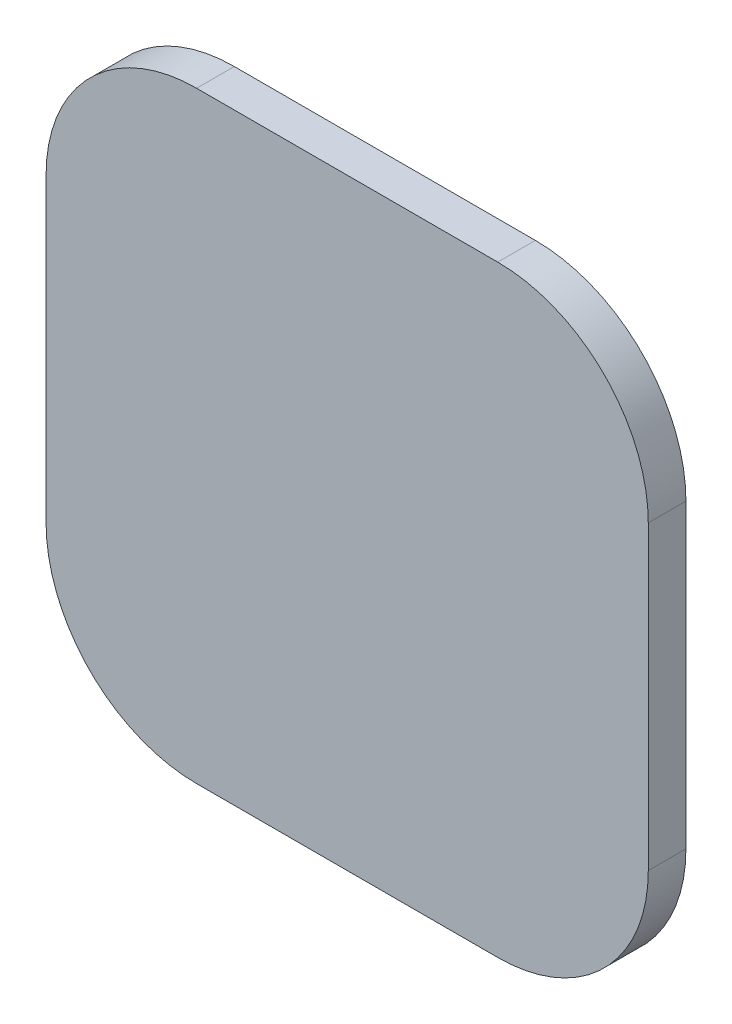
ISO-10303-21;
HEADER;
FILE_DESCRIPTION(('STEP AP214'),'2;1');
FILE_NAME('part.step','',(''),(''),'','','');
FILE_SCHEMA(('AUTOMOTIVE_DESIGN { 1 0 10303 214 1 1 1 1 }'));
ENDSEC;
DATA;
#1=APPLICATION_CONTEXT('core data for automotive mechanical design processes');
#2=APPLICATION_PROTOCOL_DEFINITION('international standard','automotive_design',2000,#1);
#3=PRODUCT_CONTEXT('',#1,'mechanical');
#4=PRODUCT('Part','Part','',(#3));
#5=PRODUCT_RELATED_PRODUCT_CATEGORY('part','',(#4));
#6=PRODUCT_DEFINITION_FORMATION('','',#4);
#7=PRODUCT_DEFINITION_CONTEXT('part definition',#1,'design');
#8=PRODUCT_DEFINITION('design','',#6,#7);
#9=PRODUCT_DEFINITION_SHAPE('','',#8);
#10=(LENGTH_UNIT() NAMED_UNIT(*) SI_UNIT(.MILLI.,.METRE.));
#11=(NAMED_UNIT(*) PLANE_ANGLE_UNIT() SI_UNIT($,.RADIAN.));
#12=(NAMED_UNIT(*) SI_UNIT($,.STERADIAN.) SOLID_ANGLE_UNIT());
#13=UNCERTAINTY_MEASURE_WITH_UNIT(LENGTH_MEASURE(1.E-05),#10,'distance_accuracy_value','');
#14=(GEOMETRIC_REPRESENTATION_CONTEXT(3) GLOBAL_UNCERTAINTY_ASSIGNED_CONTEXT((#13)) GLOBAL_UNIT_ASSIGNED_CONTEXT((#10,
#11,#12)) REPRESENTATION_CONTEXT('',''));
#15=CARTESIAN_POINT('',(0.,0.,0.));
#16=DIRECTION('',(0.,0.,1.));
#17=DIRECTION('',(1.,0.,0.));
#18=AXIS2_PLACEMENT_3D('',#15,#16,#17);
#19=CARTESIAN_POINT('',(0.,0.,2.));
#20=DIRECTION('',(0.,0.,-1.));
#21=DIRECTION('',(-1.,0.,0.));
#22=AXIS2_PLACEMENT_3D('',#19,#20,#21);
#23=PLANE('',#22);
#24=CARTESIAN_POINT('',(0.,0.,2.));
#25=DIRECTION('',(0.,0.,-1.));
#26=DIRECTION('',(-1.,0.,0.));
#27=AXIS2_PLACEMENT_3D('',#24,#25,#26);
#28=CIRCLE('',#27,12.0393920141695);
#29=CARTESIAN_POINT('',(-12.0393920141695,0.,2.));
#30=VERTEX_POINT('',#29);
#31=EDGE_CURVE('E11',#30,#30,#28,.F.);
#32=ORIENTED_EDGE('',*,*,#31,.T.);
#33=EDGE_LOOP('',(#32));
#34=FACE_BOUND('',#33,.T.);
#35=CARTESIAN_POINT('',(0.,0.,2.));
#36=DIRECTION('',(0.,0.,-1.));
#37=DIRECTION('',(-1.,0.,0.));
#38=AXIS2_PLACEMENT_3D('',#35,#36,#37);
#39=CIRCLE('',#38,20.);
#40=CARTESIAN_POINT('',(-20.,0.,2.));
#41=VERTEX_POINT('',#40);
#42=EDGE_CURVE('E161',#41,#41,#39,.T.);
#43=ORIENTED_EDGE('',*,*,#42,.T.);
#44=EDGE_LOOP('',(#43));
#45=FACE_BOUND('',#44,.T.);
#46=ADVANCED_FACE('F43',(#34,#45),#23,.T.);
#47=CARTESIAN_POINT('',(20.,20.,5.));
#48=DIRECTION('',(0.,0.,-1.));
#49=DIRECTION('',(-1.,0.,0.));
#50=AXIS2_PLACEMENT_3D('',#47,#48,#49);
#51=CYLINDRICAL_SURFACE('',#50,20.);
#52=CARTESIAN_POINT('',(20.,20.,0.));
#53=DIRECTION('',(0.,0.,1.));
#54=DIRECTION('',(1.,0.,0.));
#55=AXIS2_PLACEMENT_3D('',#52,#53,#54);
#56=CIRCLE('',#55,20.);
#57=CARTESIAN_POINT('',(40.,19.9999999999999,0.));
#58=VERTEX_POINT('',#57);
#59=CARTESIAN_POINT('',(19.9999999999999,40.,0.));
#60=VERTEX_POINT('',#59);
#61=EDGE_CURVE('E156',#58,#60,#56,.T.);
#62=ORIENTED_EDGE('',*,*,#61,.T.);
#63=DIRECTION('',(0.,0.,-1.));
#64=VECTOR('',#63,1.);
#65=CARTESIAN_POINT('',(19.9999999999999,40.,5.));
#66=LINE('',#65,#64);
#67=CARTESIAN_POINT('',(19.9999999999999,40.,5.));
#68=VERTEX_POINT('',#67);
#69=EDGE_CURVE('E52',#68,#60,#66,.T.);
#70=ORIENTED_EDGE('',*,*,#69,.F.);
#71=CARTESIAN_POINT('',(20.,20.,5.));
#72=DIRECTION('',(0.,0.,1.));
#73=DIRECTION('',(1.,0.,0.));
#74=AXIS2_PLACEMENT_3D('',#71,#72,#73);
#75=CIRCLE('',#74,20.);
#76=CARTESIAN_POINT('',(40.,19.9999999999999,5.));
#77=VERTEX_POINT('',#76);
#78=EDGE_CURVE('E180',#77,#68,#75,.T.);
#79=ORIENTED_EDGE('',*,*,#78,.F.);
#80=DIRECTION('',(0.,0.,-1.));
#81=VECTOR('',#80,1.);
#82=CARTESIAN_POINT('',(40.,19.9999999999999,5.));
#83=LINE('',#82,#81);
#84=EDGE_CURVE('E152',#77,#58,#83,.T.);
#85=ORIENTED_EDGE('',*,*,#84,.T.);
#86=EDGE_LOOP('',(#62,#70,#79,#85));
#87=FACE_BOUND('',#86,.T.);
#88=ADVANCED_FACE('F204',(#87),#51,.T.);
#89=CARTESIAN_POINT('',(-19.9999999999999,40.,5.));
#90=DIRECTION('',(0.,-1.,0.));
#91=DIRECTION('',(0.,0.,-1.));
#92=AXIS2_PLACEMENT_3D('',#89,#90,#91);
#93=PLANE('',#92);
#94=DIRECTION('',(-1.,0.,0.));
#95=VECTOR('',#94,1.);
#96=CARTESIAN_POINT('',(-19.9999999999999,40.,0.));
#97=LINE('',#96,#95);
#98=CARTESIAN_POINT('',(-19.9999999999999,40.,0.));
#99=VERTEX_POINT('',#98);
#100=EDGE_CURVE('E160',#60,#99,#97,.T.);
#101=ORIENTED_EDGE('',*,*,#100,.T.);
#102=DIRECTION('',(0.,0.,-1.));
#103=VECTOR('',#102,1.);
#104=CARTESIAN_POINT('',(-19.9999999999999,40.,5.));
#105=LINE('',#104,#103);
#106=CARTESIAN_POINT('',(-19.9999999999999,40.,5.));
#107=VERTEX_POINT('',#106);
#108=EDGE_CURVE('E195',#107,#99,#105,.T.);
#109=ORIENTED_EDGE('',*,*,#108,.F.);
#110=DIRECTION('',(-1.,0.,0.));
#111=VECTOR('',#110,1.);
#112=CARTESIAN_POINT('',(-19.9999999999999,40.,5.));
#113=LINE('',#112,#111);
#114=EDGE_CURVE('E109',#68,#107,#113,.T.);
#115=ORIENTED_EDGE('',*,*,#114,.F.);
#116=ORIENTED_EDGE('',*,*,#69,.T.);
#117=EDGE_LOOP('',(#101,#109,#115,#116));
#118=FACE_BOUND('',#117,.T.);
#119=ADVANCED_FACE('F200',(#118),#93,.F.);
#120=CARTESIAN_POINT('',(-20.,20.,5.));
#121=DIRECTION('',(0.,0.,-1.));
#122=DIRECTION('',(-1.,0.,0.));
#123=AXIS2_PLACEMENT_3D('',#120,#121,#122);
#124=CYLINDRICAL_SURFACE('',#123,20.);
#125=CARTESIAN_POINT('',(-20.,20.,0.));
#126=DIRECTION('',(0.,0.,1.));
#127=DIRECTION('',(-1.,0.,0.));
#128=AXIS2_PLACEMENT_3D('',#125,#126,#127);
#129=CIRCLE('',#128,20.);
#130=CARTESIAN_POINT('',(-40.,19.9999999999999,0.));
#131=VERTEX_POINT('',#130);
#132=EDGE_CURVE('E164',#99,#131,#129,.T.);
#133=ORIENTED_EDGE('',*,*,#132,.T.);
#134=DIRECTION('',(0.,0.,-1.));
#135=VECTOR('',#134,1.);
#136=CARTESIAN_POINT('',(-40.,19.9999999999999,5.));
#137=LINE('',#136,#135);
#138=CARTESIAN_POINT('',(-40.,19.9999999999999,5.));
#139=VERTEX_POINT('',#138);
#140=EDGE_CURVE('E191',#139,#131,#137,.T.);
#141=ORIENTED_EDGE('',*,*,#140,.F.);
#142=CARTESIAN_POINT('',(-20.,20.,5.));
#143=DIRECTION('',(0.,0.,1.));
#144=DIRECTION('',(-1.,0.,0.));
#145=AXIS2_PLACEMENT_3D('',#142,#143,#144);
#146=CIRCLE('',#145,20.);
#147=EDGE_CURVE('E220',#107,#139,#146,.T.);
#148=ORIENTED_EDGE('',*,*,#147,.F.);
#149=ORIENTED_EDGE('',*,*,#108,.T.);
#150=EDGE_LOOP('',(#133,#141,#148,#149));
#151=FACE_BOUND('',#150,.T.);
#152=ADVANCED_FACE('F212',(#151),#124,.T.);
#153=CARTESIAN_POINT('',(-40.,-19.9999999999999,5.));
#154=DIRECTION('',(1.,0.,0.));
#155=DIRECTION('',(0.,0.,-1.));
#156=AXIS2_PLACEMENT_3D('',#153,#154,#155);
#157=PLANE('',#156);
#158=DIRECTION('',(0.,-1.,0.));
#159=VECTOR('',#158,1.);
#160=CARTESIAN_POINT('',(-40.,-19.9999999999999,0.));
#161=LINE('',#160,#159);
#162=CARTESIAN_POINT('',(-40.,-20.,0.));
#163=VERTEX_POINT('',#162);
#164=EDGE_CURVE('E167',#131,#163,#161,.T.);
#165=ORIENTED_EDGE('',*,*,#164,.T.);
#166=DIRECTION('',(0.,0.,-1.));
#167=VECTOR('',#166,1.);
#168=CARTESIAN_POINT('',(-40.,-20.,5.));
#169=LINE('',#168,#167);
#170=CARTESIAN_POINT('',(-40.,-20.,5.));
#171=VERTEX_POINT('',#170);
#172=EDGE_CURVE('E187',#171,#163,#169,.T.);
#173=ORIENTED_EDGE('',*,*,#172,.F.);
#174=DIRECTION('',(0.,-1.,0.));
#175=VECTOR('',#174,1.);
#176=CARTESIAN_POINT('',(-40.,-19.9999999999999,5.));
#177=LINE('',#176,#175);
#178=EDGE_CURVE('E218',#139,#171,#177,.T.);
#179=ORIENTED_EDGE('',*,*,#178,.F.);
#180=ORIENTED_EDGE('',*,*,#140,.T.);
#181=EDGE_LOOP('',(#165,#173,#179,#180));
#182=FACE_BOUND('',#181,.T.);
#183=ADVANCED_FACE('F216',(#182),#157,.F.);
#184=CARTESIAN_POINT('',(-20.,-20.,5.));
#185=DIRECTION('',(0.,0.,-1.));
#186=DIRECTION('',(-1.,0.,0.));
#187=AXIS2_PLACEMENT_3D('',#184,#185,#186);
#188=CYLINDRICAL_SURFACE('',#187,20.);
#189=CARTESIAN_POINT('',(-20.,-20.,0.));
#190=DIRECTION('',(0.,0.,1.));
#191=DIRECTION('',(-1.,0.,0.));
#192=AXIS2_PLACEMENT_3D('',#189,#190,#191);
#193=CIRCLE('',#192,20.);
#194=CARTESIAN_POINT('',(-19.9999999999999,-40.,0.));
#195=VERTEX_POINT('',#194);
#196=EDGE_CURVE('E170',#163,#195,#193,.T.);
#197=ORIENTED_EDGE('',*,*,#196,.T.);
#198=DIRECTION('',(0.,0.,-1.));
#199=VECTOR('',#198,1.);
#200=CARTESIAN_POINT('',(-19.9999999999999,-40.,5.));
#201=LINE('',#200,#199);
#202=CARTESIAN_POINT('',(-19.9999999999999,-40.,5.));
#203=VERTEX_POINT('',#202);
#204=EDGE_CURVE('E145',#203,#195,#201,.T.);
#205=ORIENTED_EDGE('',*,*,#204,.F.);
#206=CARTESIAN_POINT('',(-20.,-20.,5.));
#207=DIRECTION('',(0.,0.,1.));
#208=DIRECTION('',(-1.,0.,0.));
#209=AXIS2_PLACEMENT_3D('',#206,#207,#208);
#210=CIRCLE('',#209,20.);
#211=EDGE_CURVE('E131',#171,#203,#210,.T.);
#212=ORIENTED_EDGE('',*,*,#211,.F.);
#213=ORIENTED_EDGE('',*,*,#172,.T.);
#214=EDGE_LOOP('',(#197,#205,#212,#213));
#215=FACE_BOUND('',#214,.T.);
#216=ADVANCED_FACE('F313',(#215),#188,.T.);
#217=CARTESIAN_POINT('',(-19.9999999999999,-40.,5.));
#218=DIRECTION('',(0.,1.,0.));
#219=DIRECTION('',(0.,0.,1.));
#220=AXIS2_PLACEMENT_3D('',#217,#218,#219);
#221=PLANE('',#220);
#222=DIRECTION('',(1.,0.,0.));
#223=VECTOR('',#222,1.);
#224=CARTESIAN_POINT('',(-19.9999999999999,-40.,0.));
#225=LINE('',#224,#223);
#226=CARTESIAN_POINT('',(19.9999999999999,-40.,0.));
#227=VERTEX_POINT('',#226);
#228=EDGE_CURVE('E141',#195,#227,#225,.T.);
#229=ORIENTED_EDGE('',*,*,#228,.T.);
#230=DIRECTION('',(0.,0.,-1.));
#231=VECTOR('',#230,1.);
#232=CARTESIAN_POINT('',(19.9999999999999,-40.,5.));
#233=LINE('',#232,#231);
#234=CARTESIAN_POINT('',(19.9999999999999,-40.,5.));
#235=VERTEX_POINT('',#234);
#236=EDGE_CURVE('E138',#235,#227,#233,.T.);
#237=ORIENTED_EDGE('',*,*,#236,.F.);
#238=DIRECTION('',(1.,0.,0.));
#239=VECTOR('',#238,1.);
#240=CARTESIAN_POINT('',(-19.9999999999999,-40.,5.));
#241=LINE('',#240,#239);
#242=EDGE_CURVE('E124',#203,#235,#241,.T.);
#243=ORIENTED_EDGE('',*,*,#242,.F.);
#244=ORIENTED_EDGE('',*,*,#204,.T.);
#245=EDGE_LOOP('',(#229,#237,#243,#244));
#246=FACE_BOUND('',#245,.T.);
#247=ADVANCED_FACE('F139',(#246),#221,.F.);
#248=CARTESIAN_POINT('',(20.,-20.,5.));
#249=DIRECTION('',(0.,0.,-1.));
#250=DIRECTION('',(-1.,0.,0.));
#251=AXIS2_PLACEMENT_3D('',#248,#249,#250);
#252=CYLINDRICAL_SURFACE('',#251,20.);
#253=CARTESIAN_POINT('',(20.,-20.,0.));
#254=DIRECTION('',(0.,0.,1.));
#255=DIRECTION('',(1.,0.,0.));
#256=AXIS2_PLACEMENT_3D('',#253,#254,#255);
#257=CIRCLE('',#256,20.);
#258=CARTESIAN_POINT('',(40.,-19.9999999999999,0.));
#259=VERTEX_POINT('',#258);
#260=EDGE_CURVE('E175',#227,#259,#257,.T.);
#261=ORIENTED_EDGE('',*,*,#260,.T.);
#262=DIRECTION('',(0.,0.,-1.));
#263=VECTOR('',#262,1.);
#264=CARTESIAN_POINT('',(40.,-19.9999999999999,5.));
#265=LINE('',#264,#263);
#266=CARTESIAN_POINT('',(40.,-19.9999999999999,5.));
#267=VERTEX_POINT('',#266);
#268=EDGE_CURVE('E146',#267,#259,#265,.T.);
#269=ORIENTED_EDGE('',*,*,#268,.F.);
#270=CARTESIAN_POINT('',(20.,-20.,5.));
#271=DIRECTION('',(0.,0.,1.));
#272=DIRECTION('',(1.,0.,0.));
#273=AXIS2_PLACEMENT_3D('',#270,#271,#272);
#274=CIRCLE('',#273,20.);
#275=EDGE_CURVE('E128',#235,#267,#274,.T.);
#276=ORIENTED_EDGE('',*,*,#275,.F.);
#277=ORIENTED_EDGE('',*,*,#236,.T.);
#278=EDGE_LOOP('',(#261,#269,#276,#277));
#279=FACE_BOUND('',#278,.T.);
#280=ADVANCED_FACE('F148',(#279),#252,.T.);
#281=CARTESIAN_POINT('',(40.,-19.9999999999999,5.));
#282=DIRECTION('',(-1.,0.,0.));
#283=DIRECTION('',(0.,0.,1.));
#284=AXIS2_PLACEMENT_3D('',#281,#282,#283);
#285=PLANE('',#284);
#286=DIRECTION('',(0.,1.,0.));
#287=VECTOR('',#286,1.);
#288=CARTESIAN_POINT('',(40.,-19.9999999999999,0.));
#289=LINE('',#288,#287);
#290=EDGE_CURVE('E100',#259,#58,#289,.T.);
#291=ORIENTED_EDGE('',*,*,#290,.T.);
#292=ORIENTED_EDGE('',*,*,#84,.F.);
#293=DIRECTION('',(0.,1.,0.));
#294=VECTOR('',#293,1.);
#295=CARTESIAN_POINT('',(40.,-19.9999999999999,5.));
#296=LINE('',#295,#294);
#297=EDGE_CURVE('E67',#267,#77,#296,.T.);
#298=ORIENTED_EDGE('',*,*,#297,.F.);
#299=ORIENTED_EDGE('',*,*,#268,.T.);
#300=EDGE_LOOP('',(#291,#292,#298,#299));
#301=FACE_BOUND('',#300,.T.);
#302=ADVANCED_FACE('F304',(#301),#285,.F.);
#303=CARTESIAN_POINT('',(20.,20.,5.));
#304=DIRECTION('',(0.,0.,1.));
#305=DIRECTION('',(1.,0.,0.));
#306=AXIS2_PLACEMENT_3D('',#303,#304,#305);
#307=PLANE('',#306);
#308=ORIENTED_EDGE('',*,*,#78,.T.);
#309=ORIENTED_EDGE('',*,*,#114,.T.);
#310=ORIENTED_EDGE('',*,*,#147,.T.);
#311=ORIENTED_EDGE('',*,*,#178,.T.);
#312=ORIENTED_EDGE('',*,*,#211,.T.);
#313=ORIENTED_EDGE('',*,*,#242,.T.);
#314=ORIENTED_EDGE('',*,*,#275,.T.);
#315=ORIENTED_EDGE('',*,*,#297,.T.);
#316=EDGE_LOOP('',(#308,#309,#310,#311,#312,#313,#314,#315));
#317=FACE_BOUND('',#316,.T.);
#318=ADVANCED_FACE('F126',(#317),#307,.T.);
#319=CARTESIAN_POINT('',(20.,20.,0.));
#320=DIRECTION('',(0.,0.,1.));
#321=DIRECTION('',(1.,0.,0.));
#322=AXIS2_PLACEMENT_3D('',#319,#320,#321);
#323=PLANE('',#322);
#324=CARTESIAN_POINT('',(0.,0.,0.));
#325=DIRECTION('',(0.,0.,-1.));
#326=DIRECTION('',(-1.,0.,0.));
#327=AXIS2_PLACEMENT_3D('',#324,#325,#326);
#328=CIRCLE('',#327,20.);
#329=CARTESIAN_POINT('',(-20.,0.,0.));
#330=VERTEX_POINT('',#329);
#331=EDGE_CURVE('E230',#330,#330,#328,.T.);
#332=ORIENTED_EDGE('',*,*,#331,.F.);
#333=EDGE_LOOP('',(#332));
#334=FACE_BOUND('',#333,.T.);
#335=ORIENTED_EDGE('',*,*,#61,.F.);
#336=ORIENTED_EDGE('',*,*,#290,.F.);
#337=ORIENTED_EDGE('',*,*,#260,.F.);
#338=ORIENTED_EDGE('',*,*,#228,.F.);
#339=ORIENTED_EDGE('',*,*,#196,.F.);
#340=ORIENTED_EDGE('',*,*,#164,.F.);
#341=ORIENTED_EDGE('',*,*,#132,.F.);
#342=ORIENTED_EDGE('',*,*,#100,.F.);
#343=EDGE_LOOP('',(#335,#336,#337,#338,#339,#340,#341,#342));
#344=FACE_BOUND('',#343,.T.);
#345=ADVANCED_FACE('F206',(#334,#344),#323,.F.);
#346=CARTESIAN_POINT('',(0.,0.,2.));
#347=DIRECTION('',(0.,0.,-1.));
#348=DIRECTION('',(-1.,0.,0.));
#349=AXIS2_PLACEMENT_3D('',#346,#347,#348);
#350=CYLINDRICAL_SURFACE('',#349,20.);
#351=ORIENTED_EDGE('',*,*,#42,.F.);
#352=EDGE_LOOP('',(#351));
#353=FACE_BOUND('',#352,.T.);
#354=ORIENTED_EDGE('',*,*,#331,.T.);
#355=EDGE_LOOP('',(#354));
#356=FACE_BOUND('',#355,.T.);
#357=ADVANCED_FACE('F294',(#353,#356),#350,.F.);
#358=CARTESIAN_POINT('',(0.,0.,-5.));
#359=DIRECTION('',(0.,0.,-1.));
#360=DIRECTION('',(-1.,0.,0.));
#361=AXIS2_PLACEMENT_3D('',#358,#359,#360);
#362=PLANE('',#361);
#363=CARTESIAN_POINT('',(0.,0.,-5.));
#364=DIRECTION('',(0.,0.,-1.));
#365=DIRECTION('',(-1.,0.,0.));
#366=AXIS2_PLACEMENT_3D('',#363,#364,#365);
#367=CIRCLE('',#366,2.5);
#368=CARTESIAN_POINT('',(-2.5,0.,-5.));
#369=VERTEX_POINT('',#368);
#370=EDGE_CURVE('E234',#369,#369,#367,.T.);
#371=ORIENTED_EDGE('',*,*,#370,.T.);
#372=EDGE_LOOP('',(#371));
#373=FACE_BOUND('',#372,.T.);
#374=DIRECTION('',(0.,-1.,0.));
#375=VECTOR('',#374,1.);
#376=CARTESIAN_POINT('',(0.997797574661314,1.12,-5.));
#377=LINE('',#376,#375);
#378=CARTESIAN_POINT('',(0.997797574661314,1.12,-5.));
#379=VERTEX_POINT('',#378);
#380=CARTESIAN_POINT('',(0.997797574661314,-1.12,-5.));
#381=VERTEX_POINT('',#380);
#382=EDGE_CURVE('E249',#379,#381,#377,.T.);
#383=ORIENTED_EDGE('',*,*,#382,.F.);
#384=CARTESIAN_POINT('',(0.,0.,-5.));
#385=DIRECTION('',(0.,0.,-1.));
#386=DIRECTION('',(-1.,0.,0.));
#387=AXIS2_PLACEMENT_3D('',#384,#385,#386);
#388=CIRCLE('',#387,1.5);
#389=EDGE_CURVE('E252',#381,#379,#388,.T.);
#390=ORIENTED_EDGE('',*,*,#389,.F.);
#391=EDGE_LOOP('',(#383,#390));
#392=FACE_BOUND('',#391,.T.);
#393=ADVANCED_FACE('F270',(#373,#392),#362,.T.);
#394=CARTESIAN_POINT('',(0.,0.,-5.));
#395=DIRECTION('',(0.,0.,1.));
#396=DIRECTION('',(1.,0.,0.));
#397=AXIS2_PLACEMENT_3D('',#394,#395,#396);
#398=CYLINDRICAL_SURFACE('',#397,1.5);
#399=CARTESIAN_POINT('',(0.,0.,2.));
#400=DIRECTION('',(0.,0.,-1.));
#401=DIRECTION('',(-1.,0.,0.));
#402=AXIS2_PLACEMENT_3D('',#399,#400,#401);
#403=CIRCLE('',#402,1.5);
#404=CARTESIAN_POINT('',(0.997797574661314,-1.12,2.));
#405=VERTEX_POINT('',#404);
#406=CARTESIAN_POINT('',(0.997797574661314,1.12,2.));
#407=VERTEX_POINT('',#406);
#408=EDGE_CURVE('E253',#405,#407,#403,.T.);
#409=ORIENTED_EDGE('',*,*,#408,.F.);
#410=DIRECTION('',(0.,0.,1.));
#411=VECTOR('',#410,1.);
#412=CARTESIAN_POINT('',(0.997797574661314,-1.12,-5.));
#413=LINE('',#412,#411);
#414=EDGE_CURVE('E245',#381,#405,#413,.T.);
#415=ORIENTED_EDGE('',*,*,#414,.F.);
#416=ORIENTED_EDGE('',*,*,#389,.T.);
#417=DIRECTION('',(0.,0.,1.));
#418=VECTOR('',#417,1.);
#419=CARTESIAN_POINT('',(0.997797574661314,1.12,-5.));
#420=LINE('',#419,#418);
#421=EDGE_CURVE('E241',#379,#407,#420,.T.);
#422=ORIENTED_EDGE('',*,*,#421,.T.);
#423=EDGE_LOOP('',(#409,#415,#416,#422));
#424=FACE_BOUND('',#423,.T.);
#425=ADVANCED_FACE('F265',(#424),#398,.F.);
#426=CARTESIAN_POINT('',(0.997797574661314,1.12,-5.));
#427=DIRECTION('',(-1.,0.,0.));
#428=DIRECTION('',(0.,0.,1.));
#429=AXIS2_PLACEMENT_3D('',#426,#427,#428);
#430=PLANE('',#429);
#431=DIRECTION('',(0.,-1.,0.));
#432=VECTOR('',#431,1.);
#433=CARTESIAN_POINT('',(0.997797574661314,1.12,2.));
#434=LINE('',#433,#432);
#435=EDGE_CURVE('E58',#407,#405,#434,.T.);
#436=ORIENTED_EDGE('',*,*,#435,.F.);
#437=ORIENTED_EDGE('',*,*,#421,.F.);
#438=ORIENTED_EDGE('',*,*,#382,.T.);
#439=ORIENTED_EDGE('',*,*,#414,.T.);
#440=EDGE_LOOP('',(#436,#437,#438,#439));
#441=FACE_BOUND('',#440,.T.);
#442=ADVANCED_FACE('F272',(#441),#430,.T.);
#443=ORIENTED_EDGE('',*,*,#408,.T.);
#444=ORIENTED_EDGE('',*,*,#435,.T.);
#445=EDGE_LOOP('',(#443,#444));
#446=FACE_BOUND('',#445,.T.);
#447=ADVANCED_FACE('F274',(#446),#23,.T.);
#448=CARTESIAN_POINT('',(0.,0.,-8.));
#449=DIRECTION('',(0.,0.,-1.));
#450=DIRECTION('',(-1.,0.,0.));
#451=AXIS2_PLACEMENT_3D('',#448,#449,#450);
#452=TOROIDAL_SURFACE('',#451,12.0393920141695,10.);
#453=ORIENTED_EDGE('',*,*,#31,.F.);
#454=EDGE_LOOP('',(#453));
#455=FACE_BOUND('',#454,.T.);
#456=ORIENTED_EDGE('',*,*,#370,.F.);
#457=EDGE_LOOP('',(#456));
#458=FACE_BOUND('',#457,.T.);
#459=ADVANCED_FACE('F45',(#455,#458),#452,.F.);
#460=CLOSED_SHELL('',(#46,#88,#119,#152,#183,#216,#247,#280,#302,#318,#345,#357,#393,#425,#442,
#447,#459));
#461=MANIFOLD_SOLID_BREP('B2',#460);
#462=ADVANCED_BREP_SHAPE_REPRESENTATION('',(#18,#461),#14);
#463=SHAPE_DEFINITION_REPRESENTATION(#9,#462);
ENDSEC;
END-ISO-10303-21;
